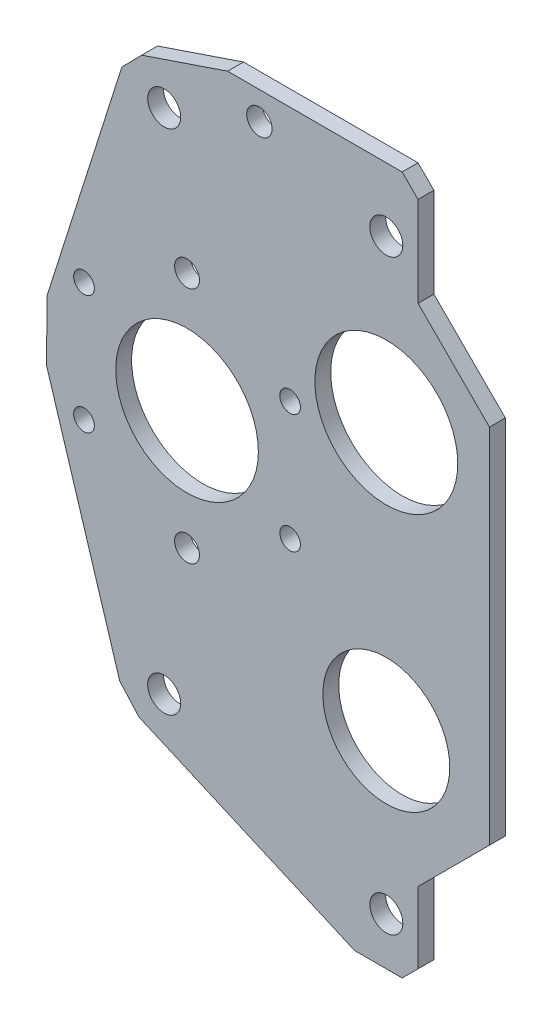
ISO-10303-21;
HEADER;
FILE_DESCRIPTION(('STEP AP214'),'2;1');
FILE_NAME('part.step','',(''),(''),'','','');
FILE_SCHEMA(('AUTOMOTIVE_DESIGN { 1 0 10303 214 1 1 1 1 }'));
ENDSEC;
DATA;
#1=APPLICATION_CONTEXT('core data for automotive mechanical design processes');
#2=APPLICATION_PROTOCOL_DEFINITION('international standard','automotive_design',2000,#1);
#3=PRODUCT_CONTEXT('',#1,'mechanical');
#4=PRODUCT('Part','Part','',(#3));
#5=PRODUCT_RELATED_PRODUCT_CATEGORY('part','',(#4));
#6=PRODUCT_DEFINITION_FORMATION('','',#4);
#7=PRODUCT_DEFINITION_CONTEXT('part definition',#1,'design');
#8=PRODUCT_DEFINITION('design','',#6,#7);
#9=PRODUCT_DEFINITION_SHAPE('','',#8);
#10=(LENGTH_UNIT() NAMED_UNIT(*) SI_UNIT(.MILLI.,.METRE.));
#11=(NAMED_UNIT(*) PLANE_ANGLE_UNIT() SI_UNIT($,.RADIAN.));
#12=(NAMED_UNIT(*) SI_UNIT($,.STERADIAN.) SOLID_ANGLE_UNIT());
#13=UNCERTAINTY_MEASURE_WITH_UNIT(LENGTH_MEASURE(1.E-05),#10,'distance_accuracy_value','');
#14=(GEOMETRIC_REPRESENTATION_CONTEXT(3) GLOBAL_UNCERTAINTY_ASSIGNED_CONTEXT((#13)) GLOBAL_UNIT_ASSIGNED_CONTEXT((#10,
#11,#12)) REPRESENTATION_CONTEXT('',''));
#15=CARTESIAN_POINT('',(0.,0.,0.));
#16=DIRECTION('',(0.,0.,1.));
#17=DIRECTION('',(1.,0.,0.));
#18=AXIS2_PLACEMENT_3D('',#15,#16,#17);
#19=CARTESIAN_POINT('',(0.,0.,0.));
#20=DIRECTION('',(0.,0.,1.));
#21=DIRECTION('',(1.,0.,0.));
#22=AXIS2_PLACEMENT_3D('',#19,#20,#21);
#23=PLANE('',#22);
#24=DIRECTION('',(-0.947188076798087,-0.32067857298476,0.));
#25=VECTOR('',#24,1.);
#26=CARTESIAN_POINT('',(-33.1609002039906,97.9473277455423,0.));
#27=LINE('',#26,#25);
#28=CARTESIAN_POINT('',(-48.9538078594664,92.6005046443076,0.));
#29=VERTEX_POINT('',#28);
#30=CARTESIAN_POINT('',(-31.75,98.425,0.));
#31=VERTEX_POINT('',#30);
#32=EDGE_CURVE('E665',#29,#31,#27,.F.);
#33=ORIENTED_EDGE('',*,*,#32,.F.);
#34=DIRECTION('',(0.7004757379388,0.713676215492077,0.));
#35=VECTOR('',#34,1.);
#36=CARTESIAN_POINT('',(-48.9538078594664,92.6005046443076,0.));
#37=LINE('',#36,#35);
#38=CARTESIAN_POINT('',(-52.9229679271194,88.5565456856429,0.));
#39=VERTEX_POINT('',#38);
#40=EDGE_CURVE('E657',#29,#39,#37,.F.);
#41=ORIENTED_EDGE('',*,*,#40,.T.);
#42=DIRECTION('',(-0.302941078368201,-0.953009288011985,0.));
#43=VECTOR('',#42,1.);
#44=CARTESIAN_POINT('',(-73.6328287693253,23.4062866241446,0.));
#45=LINE('',#44,#43);
#46=CARTESIAN_POINT('',(-67.9263241523619,41.3581336676134,0.));
#47=VERTEX_POINT('',#46);
#48=EDGE_CURVE('E655',#47,#39,#45,.F.);
#49=ORIENTED_EDGE('',*,*,#48,.F.);
#50=DIRECTION('',(0.00396394921512312,0.999992143522448,0.));
#51=VECTOR('',#50,1.);
#52=CARTESIAN_POINT('',(-67.9263241523619,41.3581336676133,0.));
#53=LINE('',#52,#51);
#54=CARTESIAN_POINT('',(-67.9743607697863,29.2398552995184,0.));
#55=VERTEX_POINT('',#54);
#56=EDGE_CURVE('E648',#47,#55,#53,.F.);
#57=ORIENTED_EDGE('',*,*,#56,.T.);
#58=DIRECTION('',(0.295376256726555,-0.955381006176179,0.));
#59=VECTOR('',#58,1.);
#60=CARTESIAN_POINT('',(-53.7923971636767,-16.6310579882147,0.));
#61=LINE('',#60,#59);
#62=CARTESIAN_POINT('',(-53.3456573135953,-18.0760176210564,0.));
#63=VERTEX_POINT('',#62);
#64=EDGE_CURVE('E144',#63,#55,#61,.F.);
#65=ORIENTED_EDGE('',*,*,#64,.F.);
#66=DIRECTION('',(-0.666107578502949,0.745855678976126,0.));
#67=VECTOR('',#66,1.);
#68=CARTESIAN_POINT('',(-53.3456573135953,-18.0760176210564,0.));
#69=LINE('',#68,#67);
#70=CARTESIAN_POINT('',(-49.4993940732019,-22.3827653195768,0.));
#71=VERTEX_POINT('',#70);
#72=EDGE_CURVE('E139',#63,#71,#69,.F.);
#73=ORIENTED_EDGE('',*,*,#72,.T.);
#74=DIRECTION('',(0.916045236310745,-0.401074961861734,0.));
#75=VECTOR('',#74,1.);
#76=CARTESIAN_POINT('',(-16.1860190531105,-36.9684648964657,0.));
#77=LINE('',#76,#75);
#78=CARTESIAN_POINT('',(-6.34999999999987,-41.275,0.));
#79=VERTEX_POINT('',#78);
#80=EDGE_CURVE('E130',#79,#71,#77,.F.);
#81=ORIENTED_EDGE('',*,*,#80,.F.);
#82=DIRECTION('',(1.,0.,0.));
#83=VECTOR('',#82,1.);
#84=CARTESIAN_POINT('',(-76.2,-41.275,0.));
#85=LINE('',#84,#83);
#86=CARTESIAN_POINT('',(3.17499999999999,-41.275,0.));
#87=VERTEX_POINT('',#86);
#88=EDGE_CURVE('E125',#87,#79,#85,.F.);
#89=ORIENTED_EDGE('',*,*,#88,.F.);
#90=DIRECTION('',(0.707106781186547,0.707106781186548,0.));
#91=VECTOR('',#90,1.);
#92=CARTESIAN_POINT('',(6.35,-38.1,0.));
#93=LINE('',#92,#91);
#94=CARTESIAN_POINT('',(6.35,-38.1,0.));
#95=VERTEX_POINT('',#94);
#96=EDGE_CURVE('E702',#95,#87,#93,.F.);
#97=ORIENTED_EDGE('',*,*,#96,.F.);
#98=DIRECTION('',(0.,-1.,0.));
#99=VECTOR('',#98,1.);
#100=CARTESIAN_POINT('',(6.35000000000001,-23.8252,0.));
#101=LINE('',#100,#99);
#102=CARTESIAN_POINT('',(6.35,-23.8252,0.));
#103=VERTEX_POINT('',#102);
#104=EDGE_CURVE('E696',#95,#103,#101,.F.);
#105=ORIENTED_EDGE('',*,*,#104,.T.);
#106=DIRECTION('',(-0.707106781186549,-0.707106781186546,0.));
#107=VECTOR('',#106,1.);
#108=CARTESIAN_POINT('',(20.6502,-9.525,0.));
#109=LINE('',#108,#107);
#110=CARTESIAN_POINT('',(20.6502,-9.52500000000001,0.));
#111=VERTEX_POINT('',#110);
#112=EDGE_CURVE('E691',#103,#111,#109,.F.);
#113=ORIENTED_EDGE('',*,*,#112,.T.);
#114=DIRECTION('',(0.,-1.,0.));
#115=VECTOR('',#114,1.);
#116=CARTESIAN_POINT('',(20.6502,62.9412,0.));
#117=LINE('',#116,#115);
#118=CARTESIAN_POINT('',(20.6502,62.9412,0.));
#119=VERTEX_POINT('',#118);
#120=EDGE_CURVE('E686',#111,#119,#117,.F.);
#121=ORIENTED_EDGE('',*,*,#120,.T.);
#122=DIRECTION('',(0.707106781186549,-0.707106781186546,0.));
#123=VECTOR('',#122,1.);
#124=CARTESIAN_POINT('',(6.35000000000002,77.2414,0.));
#125=LINE('',#124,#123);
#126=CARTESIAN_POINT('',(6.35000000000002,77.2414,0.));
#127=VERTEX_POINT('',#126);
#128=EDGE_CURVE('E681',#119,#127,#125,.F.);
#129=ORIENTED_EDGE('',*,*,#128,.T.);
#130=DIRECTION('',(0.,-1.,0.));
#131=VECTOR('',#130,1.);
#132=CARTESIAN_POINT('',(6.35000000000002,98.425,0.));
#133=LINE('',#132,#131);
#134=CARTESIAN_POINT('',(6.35000000000002,95.25,0.));
#135=VERTEX_POINT('',#134);
#136=EDGE_CURVE('E675',#127,#135,#133,.F.);
#137=ORIENTED_EDGE('',*,*,#136,.T.);
#138=DIRECTION('',(-0.707106781186547,0.707106781186548,0.));
#139=VECTOR('',#138,1.);
#140=CARTESIAN_POINT('',(3.17500000000003,98.425,0.));
#141=LINE('',#140,#139);
#142=CARTESIAN_POINT('',(3.17500000000003,98.425,0.));
#143=VERTEX_POINT('',#142);
#144=EDGE_CURVE('E673',#143,#135,#141,.F.);
#145=ORIENTED_EDGE('',*,*,#144,.F.);
#146=DIRECTION('',(1.,0.,0.));
#147=VECTOR('',#146,1.);
#148=CARTESIAN_POINT('',(-76.2,98.425,0.));
#149=LINE('',#148,#147);
#150=EDGE_CURVE('E669',#31,#143,#149,.T.);
#151=ORIENTED_EDGE('',*,*,#150,.F.);
#152=EDGE_LOOP('',(#33,#41,#49,#57,#65,#73,#81,#89,#97,#105,#113,#121,#129,#137,#145,#151));
#153=FACE_BOUND('',#152,.T.);
#154=CARTESIAN_POINT('',(0.,-31.75,0.));
#155=DIRECTION('',(0.,0.,1.));
#156=DIRECTION('',(1.,0.,0.));
#157=AXIS2_PLACEMENT_3D('',#154,#155,#156);
#158=CIRCLE('',#157,3.302);
#159=CARTESIAN_POINT('',(3.30199999999998,-31.75,0.));
#160=VERTEX_POINT('',#159);
#161=EDGE_CURVE('E148',#160,#160,#158,.F.);
#162=ORIENTED_EDGE('',*,*,#161,.T.);
#163=EDGE_LOOP('',(#162));
#164=FACE_BOUND('',#163,.T.);
#165=CARTESIAN_POINT('',(0.,85.725,0.));
#166=DIRECTION('',(0.,0.,1.));
#167=DIRECTION('',(1.,0.,0.));
#168=AXIS2_PLACEMENT_3D('',#165,#166,#167);
#169=CIRCLE('',#168,3.30199999999999);
#170=CARTESIAN_POINT('',(3.30199999999996,85.725,0.));
#171=VERTEX_POINT('',#170);
#172=EDGE_CURVE('E202',#171,#171,#169,.F.);
#173=ORIENTED_EDGE('',*,*,#172,.T.);
#174=EDGE_LOOP('',(#173));
#175=FACE_BOUND('',#174,.T.);
#176=CARTESIAN_POINT('',(-25.4,92.8624,0.));
#177=DIRECTION('',(0.,0.,1.));
#178=DIRECTION('',(1.,0.,0.));
#179=AXIS2_PLACEMENT_3D('',#176,#177,#178);
#180=CIRCLE('',#179,2.54);
#181=CARTESIAN_POINT('',(-22.86,92.8624,0.));
#182=VERTEX_POINT('',#181);
#183=EDGE_CURVE('E205',#182,#182,#180,.F.);
#184=ORIENTED_EDGE('',*,*,#183,.T.);
#185=EDGE_LOOP('',(#184));
#186=FACE_BOUND('',#185,.T.);
#187=CARTESIAN_POINT('',(0.,53.4162,0.));
#188=DIRECTION('',(0.,0.,1.));
#189=DIRECTION('',(1.,0.,0.));
#190=AXIS2_PLACEMENT_3D('',#187,#188,#189);
#191=CIRCLE('',#190,14.3002);
#192=CARTESIAN_POINT('',(14.3002,53.4162,0.));
#193=VERTEX_POINT('',#192);
#194=EDGE_CURVE('E208',#193,#193,#191,.F.);
#195=ORIENTED_EDGE('',*,*,#194,.T.);
#196=EDGE_LOOP('',(#195));
#197=FACE_BOUND('',#196,.T.);
#198=CARTESIAN_POINT('',(-39.878,35.5392112804997,0.));
#199=DIRECTION('',(0.,0.,1.));
#200=DIRECTION('',(1.,0.,0.));
#201=AXIS2_PLACEMENT_3D('',#198,#199,#200);
#202=CIRCLE('',#201,14.2748);
#203=CARTESIAN_POINT('',(-25.6032,35.5392112804997,0.));
#204=VERTEX_POINT('',#203);
#205=EDGE_CURVE('E211',#204,#204,#202,.F.);
#206=ORIENTED_EDGE('',*,*,#205,.T.);
#207=EDGE_LOOP('',(#206));
#208=FACE_BOUND('',#207,.T.);
#209=CARTESIAN_POINT('',(0.,0.,0.));
#210=DIRECTION('',(0.,0.,1.));
#211=DIRECTION('',(1.,0.,0.));
#212=AXIS2_PLACEMENT_3D('',#209,#210,#211);
#213=CIRCLE('',#212,12.7);
#214=CARTESIAN_POINT('',(12.7,0.,0.));
#215=VERTEX_POINT('',#214);
#216=EDGE_CURVE('E214',#215,#215,#213,.F.);
#217=ORIENTED_EDGE('',*,*,#216,.T.);
#218=EDGE_LOOP('',(#217));
#219=FACE_BOUND('',#218,.T.);
#220=CARTESIAN_POINT('',(-44.45,-15.875,0.));
#221=DIRECTION('',(0.,0.,1.));
#222=DIRECTION('',(1.,0.,0.));
#223=AXIS2_PLACEMENT_3D('',#220,#221,#222);
#224=CIRCLE('',#223,3.302);
#225=CARTESIAN_POINT('',(-41.148,-15.875,0.));
#226=VERTEX_POINT('',#225);
#227=EDGE_CURVE('E217',#226,#226,#224,.F.);
#228=ORIENTED_EDGE('',*,*,#227,.T.);
#229=EDGE_LOOP('',(#228));
#230=FACE_BOUND('',#229,.T.);
#231=CARTESIAN_POINT('',(-44.45,85.725,0.));
#232=DIRECTION('',(0.,0.,1.));
#233=DIRECTION('',(1.,0.,0.));
#234=AXIS2_PLACEMENT_3D('',#231,#232,#233);
#235=CIRCLE('',#234,3.302);
#236=CARTESIAN_POINT('',(-41.148,85.725,0.));
#237=VERTEX_POINT('',#236);
#238=EDGE_CURVE('E220',#237,#237,#235,.F.);
#239=ORIENTED_EDGE('',*,*,#238,.T.);
#240=EDGE_LOOP('',(#239));
#241=FACE_BOUND('',#240,.T.);
#242=CARTESIAN_POINT('',(-39.878,11.7267112804997,0.));
#243=DIRECTION('',(0.,0.,-1.));
#244=DIRECTION('',(-1.,0.,0.));
#245=AXIS2_PLACEMENT_3D('',#242,#243,#244);
#246=CIRCLE('',#245,2.4892);
#247=CARTESIAN_POINT('',(-42.3672,11.7267112804997,0.));
#248=VERTEX_POINT('',#247);
#249=EDGE_CURVE('E223',#248,#248,#246,.T.);
#250=ORIENTED_EDGE('',*,*,#249,.T.);
#251=EDGE_LOOP('',(#250));
#252=FACE_BOUND('',#251,.T.);
#253=CARTESIAN_POINT('',(-19.255770072383,23.6329612804998,0.));
#254=DIRECTION('',(0.,0.,-1.));
#255=DIRECTION('',(-1.,0.,0.));
#256=AXIS2_PLACEMENT_3D('',#253,#254,#255);
#257=CIRCLE('',#256,2.0701);
#258=CARTESIAN_POINT('',(-21.325870072383,23.6329612804998,0.));
#259=VERTEX_POINT('',#258);
#260=EDGE_CURVE('E226',#259,#259,#257,.T.);
#261=ORIENTED_EDGE('',*,*,#260,.T.);
#262=EDGE_LOOP('',(#261));
#263=FACE_BOUND('',#262,.T.);
#264=CARTESIAN_POINT('',(-19.2557700723831,47.4454612804998,0.));
#265=DIRECTION('',(0.,0.,-1.));
#266=DIRECTION('',(-1.,0.,0.));
#267=AXIS2_PLACEMENT_3D('',#264,#265,#266);
#268=CIRCLE('',#267,2.07010000000001);
#269=CARTESIAN_POINT('',(-21.3258700723831,47.4454612804998,0.));
#270=VERTEX_POINT('',#269);
#271=EDGE_CURVE('E229',#270,#270,#268,.T.);
#272=ORIENTED_EDGE('',*,*,#271,.T.);
#273=EDGE_LOOP('',(#272));
#274=FACE_BOUND('',#273,.T.);
#275=CARTESIAN_POINT('',(-39.878,59.3517112804997,0.));
#276=DIRECTION('',(0.,0.,-1.));
#277=DIRECTION('',(-1.,0.,0.));
#278=AXIS2_PLACEMENT_3D('',#275,#276,#277);
#279=CIRCLE('',#278,2.4892);
#280=CARTESIAN_POINT('',(-42.3672,59.3517112804997,0.));
#281=VERTEX_POINT('',#280);
#282=EDGE_CURVE('E232',#281,#281,#279,.T.);
#283=ORIENTED_EDGE('',*,*,#282,.T.);
#284=EDGE_LOOP('',(#283));
#285=FACE_BOUND('',#284,.T.);
#286=CARTESIAN_POINT('',(-60.5002299276169,23.6329612804996,0.));
#287=DIRECTION('',(0.,0.,-1.));
#288=DIRECTION('',(-1.,0.,0.));
#289=AXIS2_PLACEMENT_3D('',#286,#287,#288);
#290=CIRCLE('',#289,2.0701);
#291=CARTESIAN_POINT('',(-62.5703299276169,23.6329612804996,0.));
#292=VERTEX_POINT('',#291);
#293=EDGE_CURVE('E234',#292,#292,#290,.T.);
#294=ORIENTED_EDGE('',*,*,#293,.T.);
#295=EDGE_LOOP('',(#294));
#296=FACE_BOUND('',#295,.T.);
#297=CARTESIAN_POINT('',(-60.500229927617,47.4454612804997,0.));
#298=DIRECTION('',(0.,0.,-1.));
#299=DIRECTION('',(-1.,0.,0.));
#300=AXIS2_PLACEMENT_3D('',#297,#298,#299);
#301=CIRCLE('',#300,2.07009999999999);
#302=CARTESIAN_POINT('',(-62.570329927617,47.4454612804997,0.));
#303=VERTEX_POINT('',#302);
#304=EDGE_CURVE('E19',#303,#303,#301,.T.);
#305=ORIENTED_EDGE('',*,*,#304,.T.);
#306=EDGE_LOOP('',(#305));
#307=FACE_BOUND('',#306,.T.);
#308=ADVANCED_FACE('F16',(#153,#164,#175,#186,#197,#208,#219,#230,#241,#252,#263,#274,#285,#296,
#307),#23,.T.);
#309=CARTESIAN_POINT('',(-60.500229927617,47.4454612804997,0.));
#310=DIRECTION('',(0.,0.,-1.));
#311=DIRECTION('',(-1.,0.,0.));
#312=AXIS2_PLACEMENT_3D('',#309,#310,#311);
#313=CYLINDRICAL_SURFACE('',#312,2.07009999999999);
#314=ORIENTED_EDGE('',*,*,#304,.F.);
#315=EDGE_LOOP('',(#314));
#316=FACE_BOUND('',#315,.T.);
#317=CARTESIAN_POINT('',(-60.500229927617,47.4454612804997,-3.175));
#318=DIRECTION('',(0.,0.,-1.));
#319=DIRECTION('',(-1.,0.,0.));
#320=AXIS2_PLACEMENT_3D('',#317,#318,#319);
#321=CIRCLE('',#320,2.07009999999999);
#322=CARTESIAN_POINT('',(-62.570329927617,47.4454612804997,-3.175));
#323=VERTEX_POINT('',#322);
#324=EDGE_CURVE('E196',#323,#323,#321,.T.);
#325=ORIENTED_EDGE('',*,*,#324,.T.);
#326=EDGE_LOOP('',(#325));
#327=FACE_BOUND('',#326,.T.);
#328=ADVANCED_FACE('F242',(#316,#327),#313,.F.);
#329=CARTESIAN_POINT('',(-60.5002299276169,23.6329612804996,0.));
#330=DIRECTION('',(0.,0.,-1.));
#331=DIRECTION('',(-1.,0.,0.));
#332=AXIS2_PLACEMENT_3D('',#329,#330,#331);
#333=CYLINDRICAL_SURFACE('',#332,2.0701);
#334=ORIENTED_EDGE('',*,*,#293,.F.);
#335=EDGE_LOOP('',(#334));
#336=FACE_BOUND('',#335,.T.);
#337=CARTESIAN_POINT('',(-60.5002299276169,23.6329612804996,-3.175));
#338=DIRECTION('',(0.,0.,-1.));
#339=DIRECTION('',(-1.,0.,0.));
#340=AXIS2_PLACEMENT_3D('',#337,#338,#339);
#341=CIRCLE('',#340,2.0701);
#342=CARTESIAN_POINT('',(-62.5703299276169,23.6329612804996,-3.175));
#343=VERTEX_POINT('',#342);
#344=EDGE_CURVE('E193',#343,#343,#341,.T.);
#345=ORIENTED_EDGE('',*,*,#344,.T.);
#346=EDGE_LOOP('',(#345));
#347=FACE_BOUND('',#346,.T.);
#348=ADVANCED_FACE('F245',(#336,#347),#333,.F.);
#349=CARTESIAN_POINT('',(-39.878,59.3517112804997,0.));
#350=DIRECTION('',(0.,0.,-1.));
#351=DIRECTION('',(-1.,0.,0.));
#352=AXIS2_PLACEMENT_3D('',#349,#350,#351);
#353=CYLINDRICAL_SURFACE('',#352,2.4892);
#354=ORIENTED_EDGE('',*,*,#282,.F.);
#355=EDGE_LOOP('',(#354));
#356=FACE_BOUND('',#355,.T.);
#357=CARTESIAN_POINT('',(-39.878,59.3517112804997,-3.175));
#358=DIRECTION('',(0.,0.,-1.));
#359=DIRECTION('',(-1.,0.,0.));
#360=AXIS2_PLACEMENT_3D('',#357,#358,#359);
#361=CIRCLE('',#360,2.4892);
#362=CARTESIAN_POINT('',(-42.3672,59.3517112804997,-3.175));
#363=VERTEX_POINT('',#362);
#364=EDGE_CURVE('E190',#363,#363,#361,.T.);
#365=ORIENTED_EDGE('',*,*,#364,.T.);
#366=EDGE_LOOP('',(#365));
#367=FACE_BOUND('',#366,.T.);
#368=ADVANCED_FACE('F359',(#356,#367),#353,.F.);
#369=CARTESIAN_POINT('',(-19.2557700723831,47.4454612804998,0.));
#370=DIRECTION('',(0.,0.,-1.));
#371=DIRECTION('',(-1.,0.,0.));
#372=AXIS2_PLACEMENT_3D('',#369,#370,#371);
#373=CYLINDRICAL_SURFACE('',#372,2.07010000000001);
#374=ORIENTED_EDGE('',*,*,#271,.F.);
#375=EDGE_LOOP('',(#374));
#376=FACE_BOUND('',#375,.T.);
#377=CARTESIAN_POINT('',(-19.2557700723831,47.4454612804998,-3.175));
#378=DIRECTION('',(0.,0.,-1.));
#379=DIRECTION('',(-1.,0.,0.));
#380=AXIS2_PLACEMENT_3D('',#377,#378,#379);
#381=CIRCLE('',#380,2.07010000000001);
#382=CARTESIAN_POINT('',(-21.3258700723831,47.4454612804998,-3.175));
#383=VERTEX_POINT('',#382);
#384=EDGE_CURVE('E187',#383,#383,#381,.T.);
#385=ORIENTED_EDGE('',*,*,#384,.T.);
#386=EDGE_LOOP('',(#385));
#387=FACE_BOUND('',#386,.T.);
#388=ADVANCED_FACE('F355',(#376,#387),#373,.F.);
#389=CARTESIAN_POINT('',(-19.255770072383,23.6329612804998,0.));
#390=DIRECTION('',(0.,0.,-1.));
#391=DIRECTION('',(-1.,0.,0.));
#392=AXIS2_PLACEMENT_3D('',#389,#390,#391);
#393=CYLINDRICAL_SURFACE('',#392,2.0701);
#394=ORIENTED_EDGE('',*,*,#260,.F.);
#395=EDGE_LOOP('',(#394));
#396=FACE_BOUND('',#395,.T.);
#397=CARTESIAN_POINT('',(-19.255770072383,23.6329612804998,-3.175));
#398=DIRECTION('',(0.,0.,-1.));
#399=DIRECTION('',(-1.,0.,0.));
#400=AXIS2_PLACEMENT_3D('',#397,#398,#399);
#401=CIRCLE('',#400,2.0701);
#402=CARTESIAN_POINT('',(-21.325870072383,23.6329612804998,-3.175));
#403=VERTEX_POINT('',#402);
#404=EDGE_CURVE('E184',#403,#403,#401,.T.);
#405=ORIENTED_EDGE('',*,*,#404,.T.);
#406=EDGE_LOOP('',(#405));
#407=FACE_BOUND('',#406,.T.);
#408=ADVANCED_FACE('F351',(#396,#407),#393,.F.);
#409=CARTESIAN_POINT('',(-39.878,11.7267112804997,0.));
#410=DIRECTION('',(0.,0.,-1.));
#411=DIRECTION('',(-1.,0.,0.));
#412=AXIS2_PLACEMENT_3D('',#409,#410,#411);
#413=CYLINDRICAL_SURFACE('',#412,2.4892);
#414=ORIENTED_EDGE('',*,*,#249,.F.);
#415=EDGE_LOOP('',(#414));
#416=FACE_BOUND('',#415,.T.);
#417=CARTESIAN_POINT('',(-39.878,11.7267112804997,-3.175));
#418=DIRECTION('',(0.,0.,-1.));
#419=DIRECTION('',(-1.,0.,0.));
#420=AXIS2_PLACEMENT_3D('',#417,#418,#419);
#421=CIRCLE('',#420,2.4892);
#422=CARTESIAN_POINT('',(-42.3672,11.7267112804997,-3.175));
#423=VERTEX_POINT('',#422);
#424=EDGE_CURVE('E181',#423,#423,#421,.T.);
#425=ORIENTED_EDGE('',*,*,#424,.T.);
#426=EDGE_LOOP('',(#425));
#427=FACE_BOUND('',#426,.T.);
#428=ADVANCED_FACE('F347',(#416,#427),#413,.F.);
#429=CARTESIAN_POINT('',(-44.45,85.725,-3.175));
#430=DIRECTION('',(0.,0.,1.));
#431=DIRECTION('',(1.,0.,0.));
#432=AXIS2_PLACEMENT_3D('',#429,#430,#431);
#433=CYLINDRICAL_SURFACE('',#432,3.302);
#434=CARTESIAN_POINT('',(-44.45,85.725,-3.175));
#435=DIRECTION('',(0.,0.,1.));
#436=DIRECTION('',(1.,0.,0.));
#437=AXIS2_PLACEMENT_3D('',#434,#435,#436);
#438=CIRCLE('',#437,3.302);
#439=CARTESIAN_POINT('',(-41.148,85.725,-3.175));
#440=VERTEX_POINT('',#439);
#441=EDGE_CURVE('E178',#440,#440,#438,.F.);
#442=ORIENTED_EDGE('',*,*,#441,.T.);
#443=EDGE_LOOP('',(#442));
#444=FACE_BOUND('',#443,.T.);
#445=ORIENTED_EDGE('',*,*,#238,.F.);
#446=EDGE_LOOP('',(#445));
#447=FACE_BOUND('',#446,.T.);
#448=ADVANCED_FACE('F343',(#444,#447),#433,.F.);
#449=CARTESIAN_POINT('',(-44.45,-15.875,-3.175));
#450=DIRECTION('',(0.,0.,1.));
#451=DIRECTION('',(1.,0.,0.));
#452=AXIS2_PLACEMENT_3D('',#449,#450,#451);
#453=CYLINDRICAL_SURFACE('',#452,3.302);
#454=CARTESIAN_POINT('',(-44.45,-15.875,-3.175));
#455=DIRECTION('',(0.,0.,1.));
#456=DIRECTION('',(1.,0.,0.));
#457=AXIS2_PLACEMENT_3D('',#454,#455,#456);
#458=CIRCLE('',#457,3.302);
#459=CARTESIAN_POINT('',(-41.148,-15.875,-3.175));
#460=VERTEX_POINT('',#459);
#461=EDGE_CURVE('E175',#460,#460,#458,.F.);
#462=ORIENTED_EDGE('',*,*,#461,.T.);
#463=EDGE_LOOP('',(#462));
#464=FACE_BOUND('',#463,.T.);
#465=ORIENTED_EDGE('',*,*,#227,.F.);
#466=EDGE_LOOP('',(#465));
#467=FACE_BOUND('',#466,.T.);
#468=ADVANCED_FACE('F339',(#464,#467),#453,.F.);
#469=CARTESIAN_POINT('',(0.,0.,-3.175));
#470=DIRECTION('',(0.,0.,1.));
#471=DIRECTION('',(1.,0.,0.));
#472=AXIS2_PLACEMENT_3D('',#469,#470,#471);
#473=CYLINDRICAL_SURFACE('',#472,12.7);
#474=CARTESIAN_POINT('',(0.,0.,-3.175));
#475=DIRECTION('',(0.,0.,1.));
#476=DIRECTION('',(1.,0.,0.));
#477=AXIS2_PLACEMENT_3D('',#474,#475,#476);
#478=CIRCLE('',#477,12.7);
#479=CARTESIAN_POINT('',(12.7,0.,-3.175));
#480=VERTEX_POINT('',#479);
#481=EDGE_CURVE('E172',#480,#480,#478,.F.);
#482=ORIENTED_EDGE('',*,*,#481,.T.);
#483=EDGE_LOOP('',(#482));
#484=FACE_BOUND('',#483,.T.);
#485=ORIENTED_EDGE('',*,*,#216,.F.);
#486=EDGE_LOOP('',(#485));
#487=FACE_BOUND('',#486,.T.);
#488=ADVANCED_FACE('F335',(#484,#487),#473,.F.);
#489=CARTESIAN_POINT('',(-39.878,35.5392112804997,-3.175));
#490=DIRECTION('',(0.,0.,1.));
#491=DIRECTION('',(1.,0.,0.));
#492=AXIS2_PLACEMENT_3D('',#489,#490,#491);
#493=CYLINDRICAL_SURFACE('',#492,14.2748);
#494=CARTESIAN_POINT('',(-39.878,35.5392112804997,-3.175));
#495=DIRECTION('',(0.,0.,1.));
#496=DIRECTION('',(1.,0.,0.));
#497=AXIS2_PLACEMENT_3D('',#494,#495,#496);
#498=CIRCLE('',#497,14.2748);
#499=CARTESIAN_POINT('',(-25.6032,35.5392112804997,-3.175));
#500=VERTEX_POINT('',#499);
#501=EDGE_CURVE('E169',#500,#500,#498,.F.);
#502=ORIENTED_EDGE('',*,*,#501,.T.);
#503=EDGE_LOOP('',(#502));
#504=FACE_BOUND('',#503,.T.);
#505=ORIENTED_EDGE('',*,*,#205,.F.);
#506=EDGE_LOOP('',(#505));
#507=FACE_BOUND('',#506,.T.);
#508=ADVANCED_FACE('F331',(#504,#507),#493,.F.);
#509=CARTESIAN_POINT('',(0.,53.4162,-3.175));
#510=DIRECTION('',(0.,0.,1.));
#511=DIRECTION('',(1.,0.,0.));
#512=AXIS2_PLACEMENT_3D('',#509,#510,#511);
#513=CYLINDRICAL_SURFACE('',#512,14.3002);
#514=CARTESIAN_POINT('',(0.,53.4162,-3.175));
#515=DIRECTION('',(0.,0.,1.));
#516=DIRECTION('',(1.,0.,0.));
#517=AXIS2_PLACEMENT_3D('',#514,#515,#516);
#518=CIRCLE('',#517,14.3002);
#519=CARTESIAN_POINT('',(14.3002,53.4162,-3.175));
#520=VERTEX_POINT('',#519);
#521=EDGE_CURVE('E166',#520,#520,#518,.F.);
#522=ORIENTED_EDGE('',*,*,#521,.T.);
#523=EDGE_LOOP('',(#522));
#524=FACE_BOUND('',#523,.T.);
#525=ORIENTED_EDGE('',*,*,#194,.F.);
#526=EDGE_LOOP('',(#525));
#527=FACE_BOUND('',#526,.T.);
#528=ADVANCED_FACE('F327',(#524,#527),#513,.F.);
#529=CARTESIAN_POINT('',(-25.4,92.8624,-3.175));
#530=DIRECTION('',(0.,0.,1.));
#531=DIRECTION('',(1.,0.,0.));
#532=AXIS2_PLACEMENT_3D('',#529,#530,#531);
#533=CYLINDRICAL_SURFACE('',#532,2.54);
#534=CARTESIAN_POINT('',(-25.4,92.8624,-3.175));
#535=DIRECTION('',(0.,0.,1.));
#536=DIRECTION('',(1.,0.,0.));
#537=AXIS2_PLACEMENT_3D('',#534,#535,#536);
#538=CIRCLE('',#537,2.54);
#539=CARTESIAN_POINT('',(-22.86,92.8624,-3.175));
#540=VERTEX_POINT('',#539);
#541=EDGE_CURVE('E163',#540,#540,#538,.F.);
#542=ORIENTED_EDGE('',*,*,#541,.T.);
#543=EDGE_LOOP('',(#542));
#544=FACE_BOUND('',#543,.T.);
#545=ORIENTED_EDGE('',*,*,#183,.F.);
#546=EDGE_LOOP('',(#545));
#547=FACE_BOUND('',#546,.T.);
#548=ADVANCED_FACE('F323',(#544,#547),#533,.F.);
#549=CARTESIAN_POINT('',(0.,85.725,-3.175));
#550=DIRECTION('',(0.,0.,1.));
#551=DIRECTION('',(1.,0.,0.));
#552=AXIS2_PLACEMENT_3D('',#549,#550,#551);
#553=CYLINDRICAL_SURFACE('',#552,3.30199999999999);
#554=CARTESIAN_POINT('',(0.,85.725,-3.175));
#555=DIRECTION('',(0.,0.,1.));
#556=DIRECTION('',(1.,0.,0.));
#557=AXIS2_PLACEMENT_3D('',#554,#555,#556);
#558=CIRCLE('',#557,3.30199999999999);
#559=CARTESIAN_POINT('',(3.30199999999996,85.725,-3.175));
#560=VERTEX_POINT('',#559);
#561=EDGE_CURVE('E160',#560,#560,#558,.F.);
#562=ORIENTED_EDGE('',*,*,#561,.T.);
#563=EDGE_LOOP('',(#562));
#564=FACE_BOUND('',#563,.T.);
#565=ORIENTED_EDGE('',*,*,#172,.F.);
#566=EDGE_LOOP('',(#565));
#567=FACE_BOUND('',#566,.T.);
#568=ADVANCED_FACE('F319',(#564,#567),#553,.F.);
#569=CARTESIAN_POINT('',(0.,-31.75,-3.175));
#570=DIRECTION('',(0.,0.,1.));
#571=DIRECTION('',(1.,0.,0.));
#572=AXIS2_PLACEMENT_3D('',#569,#570,#571);
#573=CYLINDRICAL_SURFACE('',#572,3.302);
#574=CARTESIAN_POINT('',(0.,-31.75,-3.175));
#575=DIRECTION('',(0.,0.,1.));
#576=DIRECTION('',(1.,0.,0.));
#577=AXIS2_PLACEMENT_3D('',#574,#575,#576);
#578=CIRCLE('',#577,3.302);
#579=CARTESIAN_POINT('',(3.30199999999998,-31.75,-3.175));
#580=VERTEX_POINT('',#579);
#581=EDGE_CURVE('E157',#580,#580,#578,.F.);
#582=ORIENTED_EDGE('',*,*,#581,.T.);
#583=EDGE_LOOP('',(#582));
#584=FACE_BOUND('',#583,.T.);
#585=ORIENTED_EDGE('',*,*,#161,.F.);
#586=EDGE_LOOP('',(#585));
#587=FACE_BOUND('',#586,.T.);
#588=ADVANCED_FACE('F316',(#584,#587),#573,.F.);
#589=CARTESIAN_POINT('',(-53.3456573135953,-18.0760176210564,-3.175));
#590=DIRECTION('',(0.745855678976126,0.666107578502949,0.));
#591=DIRECTION('',(-0.666107578502949,0.745855678976126,0.));
#592=AXIS2_PLACEMENT_3D('',#589,#590,#591);
#593=PLANE('',#592);
#594=DIRECTION('',(0.,0.,1.));
#595=VECTOR('',#594,1.);
#596=CARTESIAN_POINT('',(-49.4993940732019,-22.3827653195767,-3.175));
#597=LINE('',#596,#595);
#598=CARTESIAN_POINT('',(-49.4993940732019,-22.3827653195768,-3.175));
#599=VERTEX_POINT('',#598);
#600=EDGE_CURVE('E135',#71,#599,#597,.F.);
#601=ORIENTED_EDGE('',*,*,#600,.F.);
#602=ORIENTED_EDGE('',*,*,#72,.F.);
#603=DIRECTION('',(0.,0.,1.));
#604=VECTOR('',#603,1.);
#605=CARTESIAN_POINT('',(-53.3456573135953,-18.0760176210564,-3.175));
#606=LINE('',#605,#604);
#607=CARTESIAN_POINT('',(-53.3456573135953,-18.0760176210564,-3.175));
#608=VERTEX_POINT('',#607);
#609=EDGE_CURVE('E199',#608,#63,#606,.T.);
#610=ORIENTED_EDGE('',*,*,#609,.F.);
#611=DIRECTION('',(0.666107578502949,-0.745855678976125,0.));
#612=VECTOR('',#611,1.);
#613=CARTESIAN_POINT('',(-53.3456573135953,-18.0760176210564,-3.175));
#614=LINE('',#613,#612);
#615=EDGE_CURVE('E152',#608,#599,#614,.T.);
#616=ORIENTED_EDGE('',*,*,#615,.T.);
#617=EDGE_LOOP('',(#601,#602,#610,#616));
#618=FACE_BOUND('',#617,.T.);
#619=ADVANCED_FACE('F151',(#618),#593,.F.);
#620=CARTESIAN_POINT('',(-16.1860190531105,-36.9684648964657,-3.175));
#621=DIRECTION('',(-0.401074961861734,-0.916045236310745,0.));
#622=DIRECTION('',(0.916045236310745,-0.401074961861734,0.));
#623=AXIS2_PLACEMENT_3D('',#620,#621,#622);
#624=PLANE('',#623);
#625=DIRECTION('',(0.916045236310745,-0.401074961861733,0.));
#626=VECTOR('',#625,1.);
#627=CARTESIAN_POINT('',(-49.4993940732018,-22.3827653195768,-3.175));
#628=LINE('',#627,#626);
#629=CARTESIAN_POINT('',(-6.34999999999987,-41.275,-3.175));
#630=VERTEX_POINT('',#629);
#631=EDGE_CURVE('E636',#599,#630,#628,.T.);
#632=ORIENTED_EDGE('',*,*,#631,.T.);
#633=DIRECTION('',(0.,0.,-1.));
#634=VECTOR('',#633,1.);
#635=CARTESIAN_POINT('',(-6.34999999999987,-41.275,-3.175));
#636=LINE('',#635,#634);
#637=EDGE_CURVE('E137',#79,#630,#636,.T.);
#638=ORIENTED_EDGE('',*,*,#637,.F.);
#639=ORIENTED_EDGE('',*,*,#80,.T.);
#640=ORIENTED_EDGE('',*,*,#600,.T.);
#641=EDGE_LOOP('',(#632,#638,#639,#640));
#642=FACE_BOUND('',#641,.T.);
#643=ADVANCED_FACE('F133',(#642),#624,.T.);
#644=CARTESIAN_POINT('',(-76.2,-41.275,-3.175));
#645=DIRECTION('',(0.,-1.,0.));
#646=DIRECTION('',(0.,0.,-1.));
#647=AXIS2_PLACEMENT_3D('',#644,#645,#646);
#648=PLANE('',#647);
#649=DIRECTION('',(1.,0.,0.));
#650=VECTOR('',#649,1.);
#651=CARTESIAN_POINT('',(0.,-41.275,-3.175));
#652=LINE('',#651,#650);
#653=CARTESIAN_POINT('',(3.17499999999999,-41.275,-3.175));
#654=VERTEX_POINT('',#653);
#655=EDGE_CURVE('E632',#630,#654,#652,.T.);
#656=ORIENTED_EDGE('',*,*,#655,.T.);
#657=DIRECTION('',(0.,0.,1.));
#658=VECTOR('',#657,1.);
#659=CARTESIAN_POINT('',(3.175,-41.275,0.));
#660=LINE('',#659,#658);
#661=EDGE_CURVE('E633',#87,#654,#660,.F.);
#662=ORIENTED_EDGE('',*,*,#661,.F.);
#663=ORIENTED_EDGE('',*,*,#88,.T.);
#664=ORIENTED_EDGE('',*,*,#637,.T.);
#665=EDGE_LOOP('',(#656,#662,#663,#664));
#666=FACE_BOUND('',#665,.T.);
#667=ADVANCED_FACE('F308',(#666),#648,.T.);
#668=CARTESIAN_POINT('',(6.35,-38.1,0.));
#669=DIRECTION('',(0.707106781186548,-0.707106781186547,0.));
#670=DIRECTION('',(0.707106781186547,0.707106781186548,0.));
#671=AXIS2_PLACEMENT_3D('',#668,#669,#670);
#672=PLANE('',#671);
#673=DIRECTION('',(0.70710678118655,0.707106781186545,0.));
#674=VECTOR('',#673,1.);
#675=CARTESIAN_POINT('',(3.17499999999998,-41.275,-3.175));
#676=LINE('',#675,#674);
#677=CARTESIAN_POINT('',(6.35,-38.1,-3.175));
#678=VERTEX_POINT('',#677);
#679=EDGE_CURVE('E635',#654,#678,#676,.T.);
#680=ORIENTED_EDGE('',*,*,#679,.T.);
#681=DIRECTION('',(0.,0.,1.));
#682=VECTOR('',#681,1.);
#683=CARTESIAN_POINT('',(6.35,-38.1,0.));
#684=LINE('',#683,#682);
#685=EDGE_CURVE('E698',#678,#95,#684,.T.);
#686=ORIENTED_EDGE('',*,*,#685,.T.);
#687=ORIENTED_EDGE('',*,*,#96,.T.);
#688=ORIENTED_EDGE('',*,*,#661,.T.);
#689=EDGE_LOOP('',(#680,#686,#687,#688));
#690=FACE_BOUND('',#689,.T.);
#691=ADVANCED_FACE('F304',(#690),#672,.T.);
#692=CARTESIAN_POINT('',(6.35000000000001,-23.8252,0.));
#693=DIRECTION('',(-1.,0.,0.));
#694=DIRECTION('',(0.,-1.,0.));
#695=AXIS2_PLACEMENT_3D('',#692,#693,#694);
#696=PLANE('',#695);
#697=ORIENTED_EDGE('',*,*,#685,.F.);
#698=DIRECTION('',(0.,1.,0.));
#699=VECTOR('',#698,1.);
#700=CARTESIAN_POINT('',(6.35,0.,-3.175));
#701=LINE('',#700,#699);
#702=CARTESIAN_POINT('',(6.35,-23.8252,-3.175));
#703=VERTEX_POINT('',#702);
#704=EDGE_CURVE('E639',#678,#703,#701,.T.);
#705=ORIENTED_EDGE('',*,*,#704,.T.);
#706=DIRECTION('',(0.,0.,1.));
#707=VECTOR('',#706,1.);
#708=CARTESIAN_POINT('',(6.35,-23.8252,0.));
#709=LINE('',#708,#707);
#710=EDGE_CURVE('E693',#703,#103,#709,.T.);
#711=ORIENTED_EDGE('',*,*,#710,.T.);
#712=ORIENTED_EDGE('',*,*,#104,.F.);
#713=EDGE_LOOP('',(#697,#705,#711,#712));
#714=FACE_BOUND('',#713,.T.);
#715=ADVANCED_FACE('F300',(#714),#696,.F.);
#716=CARTESIAN_POINT('',(20.6502,-9.525,0.));
#717=DIRECTION('',(-0.707106781186546,0.707106781186549,0.));
#718=DIRECTION('',(-0.707106781186549,-0.707106781186546,0.));
#719=AXIS2_PLACEMENT_3D('',#716,#717,#718);
#720=PLANE('',#719);
#721=DIRECTION('',(0.,0.,1.));
#722=VECTOR('',#721,1.);
#723=CARTESIAN_POINT('',(20.6502,-9.52500000000001,0.));
#724=LINE('',#723,#722);
#725=CARTESIAN_POINT('',(20.6502,-9.52500000000001,-3.175));
#726=VERTEX_POINT('',#725);
#727=EDGE_CURVE('E688',#726,#111,#724,.T.);
#728=ORIENTED_EDGE('',*,*,#727,.T.);
#729=ORIENTED_EDGE('',*,*,#112,.F.);
#730=ORIENTED_EDGE('',*,*,#710,.F.);
#731=DIRECTION('',(0.707106781186549,0.707106781186546,0.));
#732=VECTOR('',#731,1.);
#733=CARTESIAN_POINT('',(6.35000000000001,-23.8252,-3.175));
#734=LINE('',#733,#732);
#735=EDGE_CURVE('E709',#703,#726,#734,.T.);
#736=ORIENTED_EDGE('',*,*,#735,.T.);
#737=EDGE_LOOP('',(#728,#729,#730,#736));
#738=FACE_BOUND('',#737,.T.);
#739=ADVANCED_FACE('F296',(#738),#720,.F.);
#740=CARTESIAN_POINT('',(20.6502,62.9412,0.));
#741=DIRECTION('',(-1.,0.,0.));
#742=DIRECTION('',(0.,-1.,0.));
#743=AXIS2_PLACEMENT_3D('',#740,#741,#742);
#744=PLANE('',#743);
#745=DIRECTION('',(0.,0.,1.));
#746=VECTOR('',#745,1.);
#747=CARTESIAN_POINT('',(20.6502,62.9412,0.));
#748=LINE('',#747,#746);
#749=CARTESIAN_POINT('',(20.6502,62.9412,-3.175));
#750=VERTEX_POINT('',#749);
#751=EDGE_CURVE('E683',#750,#119,#748,.T.);
#752=ORIENTED_EDGE('',*,*,#751,.T.);
#753=ORIENTED_EDGE('',*,*,#120,.F.);
#754=ORIENTED_EDGE('',*,*,#727,.F.);
#755=DIRECTION('',(0.,1.,0.));
#756=VECTOR('',#755,1.);
#757=CARTESIAN_POINT('',(20.6502,0.,-3.175));
#758=LINE('',#757,#756);
#759=EDGE_CURVE('E713',#726,#750,#758,.T.);
#760=ORIENTED_EDGE('',*,*,#759,.T.);
#761=EDGE_LOOP('',(#752,#753,#754,#760));
#762=FACE_BOUND('',#761,.T.);
#763=ADVANCED_FACE('F292',(#762),#744,.F.);
#764=CARTESIAN_POINT('',(6.35000000000002,77.2414,0.));
#765=DIRECTION('',(-0.707106781186546,-0.707106781186549,0.));
#766=DIRECTION('',(0.707106781186549,-0.707106781186546,0.));
#767=AXIS2_PLACEMENT_3D('',#764,#765,#766);
#768=PLANE('',#767);
#769=DIRECTION('',(0.,0.,1.));
#770=VECTOR('',#769,1.);
#771=CARTESIAN_POINT('',(6.35000000000001,77.2414,0.));
#772=LINE('',#771,#770);
#773=CARTESIAN_POINT('',(6.35000000000002,77.2414,-3.175));
#774=VERTEX_POINT('',#773);
#775=EDGE_CURVE('E678',#774,#127,#772,.T.);
#776=ORIENTED_EDGE('',*,*,#775,.T.);
#777=ORIENTED_EDGE('',*,*,#128,.F.);
#778=ORIENTED_EDGE('',*,*,#751,.F.);
#779=DIRECTION('',(-0.707106781186549,0.707106781186546,0.));
#780=VECTOR('',#779,1.);
#781=CARTESIAN_POINT('',(20.6502,62.9412,-3.175));
#782=LINE('',#781,#780);
#783=EDGE_CURVE('E715',#750,#774,#782,.T.);
#784=ORIENTED_EDGE('',*,*,#783,.T.);
#785=EDGE_LOOP('',(#776,#777,#778,#784));
#786=FACE_BOUND('',#785,.T.);
#787=ADVANCED_FACE('F288',(#786),#768,.F.);
#788=CARTESIAN_POINT('',(6.35000000000002,98.425,0.));
#789=DIRECTION('',(-1.,0.,0.));
#790=DIRECTION('',(0.,-1.,0.));
#791=AXIS2_PLACEMENT_3D('',#788,#789,#790);
#792=PLANE('',#791);
#793=DIRECTION('',(0.,0.,1.));
#794=VECTOR('',#793,1.);
#795=CARTESIAN_POINT('',(6.35000000000003,95.25,-3.175));
#796=LINE('',#795,#794);
#797=CARTESIAN_POINT('',(6.35000000000002,95.25,-3.175));
#798=VERTEX_POINT('',#797);
#799=EDGE_CURVE('E671',#135,#798,#796,.F.);
#800=ORIENTED_EDGE('',*,*,#799,.F.);
#801=ORIENTED_EDGE('',*,*,#136,.F.);
#802=ORIENTED_EDGE('',*,*,#775,.F.);
#803=DIRECTION('',(0.,1.,0.));
#804=VECTOR('',#803,1.);
#805=CARTESIAN_POINT('',(6.35000000000002,0.,-3.175));
#806=LINE('',#805,#804);
#807=EDGE_CURVE('E720',#774,#798,#806,.T.);
#808=ORIENTED_EDGE('',*,*,#807,.T.);
#809=EDGE_LOOP('',(#800,#801,#802,#808));
#810=FACE_BOUND('',#809,.T.);
#811=ADVANCED_FACE('F284',(#810),#792,.F.);
#812=CARTESIAN_POINT('',(3.17500000000003,98.425,-3.175));
#813=DIRECTION('',(0.707106781186548,0.707106781186547,0.));
#814=DIRECTION('',(-0.707106781186547,0.707106781186548,0.));
#815=AXIS2_PLACEMENT_3D('',#812,#813,#814);
#816=PLANE('',#815);
#817=DIRECTION('',(-0.707106781186547,0.707106781186548,0.));
#818=VECTOR('',#817,1.);
#819=CARTESIAN_POINT('',(6.35000000000002,95.25,-3.175));
#820=LINE('',#819,#818);
#821=CARTESIAN_POINT('',(3.17500000000003,98.425,-3.175));
#822=VERTEX_POINT('',#821);
#823=EDGE_CURVE('E723',#798,#822,#820,.T.);
#824=ORIENTED_EDGE('',*,*,#823,.T.);
#825=DIRECTION('',(0.,0.,1.));
#826=VECTOR('',#825,1.);
#827=CARTESIAN_POINT('',(3.17500000000004,98.425,-3.175));
#828=LINE('',#827,#826);
#829=EDGE_CURVE('E667',#143,#822,#828,.F.);
#830=ORIENTED_EDGE('',*,*,#829,.F.);
#831=ORIENTED_EDGE('',*,*,#144,.T.);
#832=ORIENTED_EDGE('',*,*,#799,.T.);
#833=EDGE_LOOP('',(#824,#830,#831,#832));
#834=FACE_BOUND('',#833,.T.);
#835=ADVANCED_FACE('F280',(#834),#816,.T.);
#836=CARTESIAN_POINT('',(-76.2,98.425,-3.175));
#837=DIRECTION('',(0.,1.,0.));
#838=DIRECTION('',(0.,0.,1.));
#839=AXIS2_PLACEMENT_3D('',#836,#837,#838);
#840=PLANE('',#839);
#841=ORIENTED_EDGE('',*,*,#150,.T.);
#842=ORIENTED_EDGE('',*,*,#829,.T.);
#843=DIRECTION('',(1.,0.,0.));
#844=VECTOR('',#843,1.);
#845=CARTESIAN_POINT('',(0.,98.425,-3.175));
#846=LINE('',#845,#844);
#847=CARTESIAN_POINT('',(-31.75,98.425,-3.175));
#848=VERTEX_POINT('',#847);
#849=EDGE_CURVE('E726',#822,#848,#846,.F.);
#850=ORIENTED_EDGE('',*,*,#849,.T.);
#851=DIRECTION('',(0.,0.,1.));
#852=VECTOR('',#851,1.);
#853=CARTESIAN_POINT('',(-31.7499999999999,98.425,-3.175));
#854=LINE('',#853,#852);
#855=EDGE_CURVE('E663',#31,#848,#854,.F.);
#856=ORIENTED_EDGE('',*,*,#855,.F.);
#857=EDGE_LOOP('',(#841,#842,#850,#856));
#858=FACE_BOUND('',#857,.T.);
#859=ADVANCED_FACE('F276',(#858),#840,.T.);
#860=CARTESIAN_POINT('',(-33.1609002039906,97.9473277455423,-3.175));
#861=DIRECTION('',(-0.32067857298476,0.947188076798087,0.));
#862=DIRECTION('',(-0.947188076798087,-0.32067857298476,0.));
#863=AXIS2_PLACEMENT_3D('',#860,#861,#862);
#864=PLANE('',#863);
#865=ORIENTED_EDGE('',*,*,#32,.T.);
#866=ORIENTED_EDGE('',*,*,#855,.T.);
#867=DIRECTION('',(-0.947188076798087,-0.320678572984759,0.));
#868=VECTOR('',#867,1.);
#869=CARTESIAN_POINT('',(-31.7499999999999,98.425,-3.175));
#870=LINE('',#869,#868);
#871=CARTESIAN_POINT('',(-48.9538078594664,92.6005046443076,-3.175));
#872=VERTEX_POINT('',#871);
#873=EDGE_CURVE('E729',#848,#872,#870,.T.);
#874=ORIENTED_EDGE('',*,*,#873,.T.);
#875=DIRECTION('',(0.,0.,1.));
#876=VECTOR('',#875,1.);
#877=CARTESIAN_POINT('',(-48.9538078594664,92.6005046443076,-3.175));
#878=LINE('',#877,#876);
#879=EDGE_CURVE('E660',#872,#29,#878,.T.);
#880=ORIENTED_EDGE('',*,*,#879,.T.);
#881=EDGE_LOOP('',(#865,#866,#874,#880));
#882=FACE_BOUND('',#881,.T.);
#883=ADVANCED_FACE('F272',(#882),#864,.T.);
#884=CARTESIAN_POINT('',(-48.9538078594664,92.6005046443076,-3.175));
#885=DIRECTION('',(0.713676215492077,-0.7004757379388,0.));
#886=DIRECTION('',(0.7004757379388,0.713676215492077,0.));
#887=AXIS2_PLACEMENT_3D('',#884,#885,#886);
#888=PLANE('',#887);
#889=DIRECTION('',(0.,0.,1.));
#890=VECTOR('',#889,1.);
#891=CARTESIAN_POINT('',(-52.9229679271194,88.5565456856429,-3.175));
#892=LINE('',#891,#890);
#893=CARTESIAN_POINT('',(-52.9229679271194,88.5565456856429,-3.175));
#894=VERTEX_POINT('',#893);
#895=EDGE_CURVE('E653',#39,#894,#892,.F.);
#896=ORIENTED_EDGE('',*,*,#895,.F.);
#897=ORIENTED_EDGE('',*,*,#40,.F.);
#898=ORIENTED_EDGE('',*,*,#879,.F.);
#899=DIRECTION('',(-0.700475737938801,-0.713676215492076,0.));
#900=VECTOR('',#899,1.);
#901=CARTESIAN_POINT('',(-48.9538078594664,92.6005046443076,-3.175));
#902=LINE('',#901,#900);
#903=EDGE_CURVE('E732',#872,#894,#902,.T.);
#904=ORIENTED_EDGE('',*,*,#903,.T.);
#905=EDGE_LOOP('',(#896,#897,#898,#904));
#906=FACE_BOUND('',#905,.T.);
#907=ADVANCED_FACE('F268',(#906),#888,.F.);
#908=CARTESIAN_POINT('',(-73.6328287693253,23.4062866241446,-3.175));
#909=DIRECTION('',(-0.953009288011985,0.302941078368201,0.));
#910=DIRECTION('',(-0.302941078368201,-0.953009288011985,0.));
#911=AXIS2_PLACEMENT_3D('',#908,#909,#910);
#912=PLANE('',#911);
#913=ORIENTED_EDGE('',*,*,#48,.T.);
#914=ORIENTED_EDGE('',*,*,#895,.T.);
#915=DIRECTION('',(-0.302941078368202,-0.953009288011985,0.));
#916=VECTOR('',#915,1.);
#917=CARTESIAN_POINT('',(-52.9229679271193,88.5565456856429,-3.175));
#918=LINE('',#917,#916);
#919=CARTESIAN_POINT('',(-67.9263241523619,41.3581336676134,-3.175));
#920=VERTEX_POINT('',#919);
#921=EDGE_CURVE('E735',#894,#920,#918,.T.);
#922=ORIENTED_EDGE('',*,*,#921,.T.);
#923=DIRECTION('',(0.,0.,1.));
#924=VECTOR('',#923,1.);
#925=CARTESIAN_POINT('',(-67.9263241523619,41.3581336676134,-3.175));
#926=LINE('',#925,#924);
#927=EDGE_CURVE('E650',#920,#47,#926,.T.);
#928=ORIENTED_EDGE('',*,*,#927,.T.);
#929=EDGE_LOOP('',(#913,#914,#922,#928));
#930=FACE_BOUND('',#929,.T.);
#931=ADVANCED_FACE('F264',(#930),#912,.T.);
#932=CARTESIAN_POINT('',(-67.9263241523619,41.3581336676133,-3.175));
#933=DIRECTION('',(0.999992143522448,-0.00396394921512312,0.));
#934=DIRECTION('',(0.00396394921512312,0.999992143522448,0.));
#935=AXIS2_PLACEMENT_3D('',#932,#933,#934);
#936=PLANE('',#935);
#937=DIRECTION('',(0.,0.,1.));
#938=VECTOR('',#937,1.);
#939=CARTESIAN_POINT('',(-67.9743607697863,29.2398552995184,-3.175));
#940=LINE('',#939,#938);
#941=CARTESIAN_POINT('',(-67.9743607697863,29.2398552995183,-3.175));
#942=VERTEX_POINT('',#941);
#943=EDGE_CURVE('E33',#55,#942,#940,.F.);
#944=ORIENTED_EDGE('',*,*,#943,.F.);
#945=ORIENTED_EDGE('',*,*,#56,.F.);
#946=ORIENTED_EDGE('',*,*,#927,.F.);
#947=DIRECTION('',(-0.00396394921512194,-0.999992143522448,0.));
#948=VECTOR('',#947,1.);
#949=CARTESIAN_POINT('',(-67.9263241523619,41.3581336676134,-3.175));
#950=LINE('',#949,#948);
#951=EDGE_CURVE('E25',#920,#942,#950,.T.);
#952=ORIENTED_EDGE('',*,*,#951,.T.);
#953=EDGE_LOOP('',(#944,#945,#946,#952));
#954=FACE_BOUND('',#953,.T.);
#955=ADVANCED_FACE('F257',(#954),#936,.F.);
#956=CARTESIAN_POINT('',(-53.7923971636767,-16.6310579882147,-3.175));
#957=DIRECTION('',(-0.955381006176179,-0.295376256726555,0.));
#958=DIRECTION('',(0.295376256726555,-0.955381006176179,0.));
#959=AXIS2_PLACEMENT_3D('',#956,#957,#958);
#960=PLANE('',#959);
#961=DIRECTION('',(0.295376256726555,-0.955381006176179,0.));
#962=VECTOR('',#961,1.);
#963=CARTESIAN_POINT('',(-67.9743607697863,29.2398552995183,-3.175));
#964=LINE('',#963,#962);
#965=EDGE_CURVE('E11',#942,#608,#964,.T.);
#966=ORIENTED_EDGE('',*,*,#965,.T.);
#967=ORIENTED_EDGE('',*,*,#609,.T.);
#968=ORIENTED_EDGE('',*,*,#64,.T.);
#969=ORIENTED_EDGE('',*,*,#943,.T.);
#970=EDGE_LOOP('',(#966,#967,#968,#969));
#971=FACE_BOUND('',#970,.T.);
#972=ADVANCED_FACE('F250',(#971),#960,.T.);
#973=CARTESIAN_POINT('',(0.,0.,-3.175));
#974=DIRECTION('',(0.,0.,1.));
#975=DIRECTION('',(1.,0.,0.));
#976=AXIS2_PLACEMENT_3D('',#973,#974,#975);
#977=PLANE('',#976);
#978=ORIENTED_EDGE('',*,*,#951,.F.);
#979=ORIENTED_EDGE('',*,*,#921,.F.);
#980=ORIENTED_EDGE('',*,*,#903,.F.);
#981=ORIENTED_EDGE('',*,*,#873,.F.);
#982=ORIENTED_EDGE('',*,*,#849,.F.);
#983=ORIENTED_EDGE('',*,*,#823,.F.);
#984=ORIENTED_EDGE('',*,*,#807,.F.);
#985=ORIENTED_EDGE('',*,*,#783,.F.);
#986=ORIENTED_EDGE('',*,*,#759,.F.);
#987=ORIENTED_EDGE('',*,*,#735,.F.);
#988=ORIENTED_EDGE('',*,*,#704,.F.);
#989=ORIENTED_EDGE('',*,*,#679,.F.);
#990=ORIENTED_EDGE('',*,*,#655,.F.);
#991=ORIENTED_EDGE('',*,*,#631,.F.);
#992=ORIENTED_EDGE('',*,*,#615,.F.);
#993=ORIENTED_EDGE('',*,*,#965,.F.);
#994=EDGE_LOOP('',(#978,#979,#980,#981,#982,#983,#984,#985,#986,#987,#988,#989,#990,#991,#992,#993));
#995=FACE_BOUND('',#994,.T.);
#996=ORIENTED_EDGE('',*,*,#581,.F.);
#997=EDGE_LOOP('',(#996));
#998=FACE_BOUND('',#997,.T.);
#999=ORIENTED_EDGE('',*,*,#561,.F.);
#1000=EDGE_LOOP('',(#999));
#1001=FACE_BOUND('',#1000,.T.);
#1002=ORIENTED_EDGE('',*,*,#541,.F.);
#1003=EDGE_LOOP('',(#1002));
#1004=FACE_BOUND('',#1003,.T.);
#1005=ORIENTED_EDGE('',*,*,#521,.F.);
#1006=EDGE_LOOP('',(#1005));
#1007=FACE_BOUND('',#1006,.T.);
#1008=ORIENTED_EDGE('',*,*,#501,.F.);
#1009=EDGE_LOOP('',(#1008));
#1010=FACE_BOUND('',#1009,.T.);
#1011=ORIENTED_EDGE('',*,*,#481,.F.);
#1012=EDGE_LOOP('',(#1011));
#1013=FACE_BOUND('',#1012,.T.);
#1014=ORIENTED_EDGE('',*,*,#461,.F.);
#1015=EDGE_LOOP('',(#1014));
#1016=FACE_BOUND('',#1015,.T.);
#1017=ORIENTED_EDGE('',*,*,#441,.F.);
#1018=EDGE_LOOP('',(#1017));
#1019=FACE_BOUND('',#1018,.T.);
#1020=ORIENTED_EDGE('',*,*,#424,.F.);
#1021=EDGE_LOOP('',(#1020));
#1022=FACE_BOUND('',#1021,.T.);
#1023=ORIENTED_EDGE('',*,*,#404,.F.);
#1024=EDGE_LOOP('',(#1023));
#1025=FACE_BOUND('',#1024,.T.);
#1026=ORIENTED_EDGE('',*,*,#384,.F.);
#1027=EDGE_LOOP('',(#1026));
#1028=FACE_BOUND('',#1027,.T.);
#1029=ORIENTED_EDGE('',*,*,#364,.F.);
#1030=EDGE_LOOP('',(#1029));
#1031=FACE_BOUND('',#1030,.T.);
#1032=ORIENTED_EDGE('',*,*,#344,.F.);
#1033=EDGE_LOOP('',(#1032));
#1034=FACE_BOUND('',#1033,.T.);
#1035=ORIENTED_EDGE('',*,*,#324,.F.);
#1036=EDGE_LOOP('',(#1035));
#1037=FACE_BOUND('',#1036,.T.);
#1038=ADVANCED_FACE('F248',(#995,#998,#1001,#1004,#1007,#1010,#1013,#1016,#1019,#1022,#1025,
#1028,#1031,#1034,#1037),#977,.F.);
#1039=CLOSED_SHELL('',(#308,#328,#348,#368,#388,#408,#428,#448,#468,#488,#508,#528,#548,#568,
#588,#619,#643,#667,#691,#715,#739,#763,#787,#811,#835,#859,#883,#907,#931,#955,#972,#1038));
#1040=MANIFOLD_SOLID_BREP('B1',#1039);
#1041=ADVANCED_BREP_SHAPE_REPRESENTATION('',(#18,#1040),#14);
#1042=SHAPE_DEFINITION_REPRESENTATION(#9,#1041);
ENDSEC;
END-ISO-10303-21;
